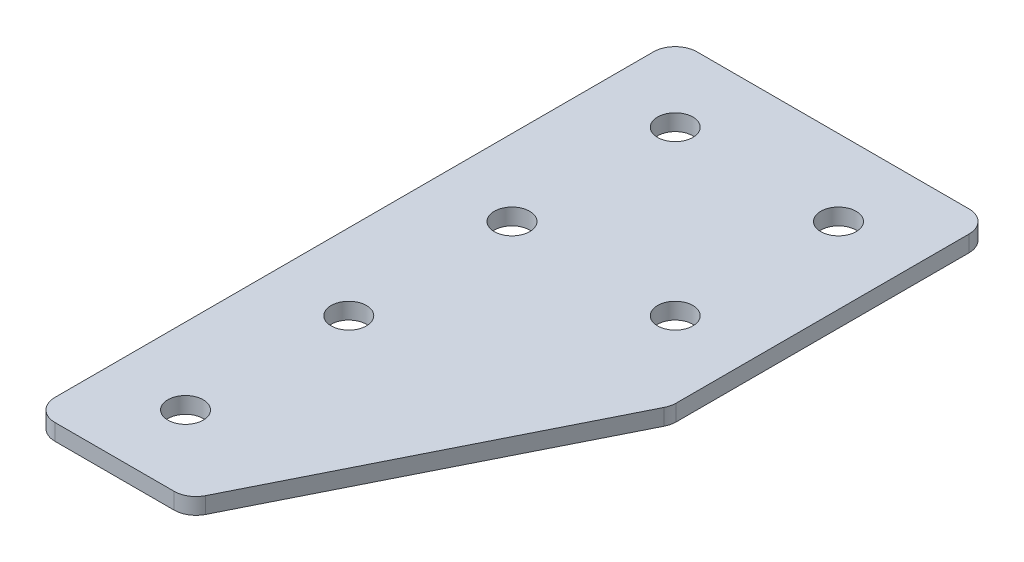
ISO-10303-21;
HEADER;
FILE_DESCRIPTION(('STEP AP214'),'2;1');
FILE_NAME('part.step','',(''),(''),'','','');
FILE_SCHEMA(('AUTOMOTIVE_DESIGN { 1 0 10303 214 1 1 1 1 }'));
ENDSEC;
DATA;
#1=APPLICATION_CONTEXT('core data for automotive mechanical design processes');
#2=APPLICATION_PROTOCOL_DEFINITION('international standard','automotive_design',2000,#1);
#3=PRODUCT_CONTEXT('',#1,'mechanical');
#4=PRODUCT('Part','Part','',(#3));
#5=PRODUCT_RELATED_PRODUCT_CATEGORY('part','',(#4));
#6=PRODUCT_DEFINITION_FORMATION('','',#4);
#7=PRODUCT_DEFINITION_CONTEXT('part definition',#1,'design');
#8=PRODUCT_DEFINITION('design','',#6,#7);
#9=PRODUCT_DEFINITION_SHAPE('','',#8);
#10=(LENGTH_UNIT() NAMED_UNIT(*) SI_UNIT(.MILLI.,.METRE.));
#11=(NAMED_UNIT(*) PLANE_ANGLE_UNIT() SI_UNIT($,.RADIAN.));
#12=(NAMED_UNIT(*) SI_UNIT($,.STERADIAN.) SOLID_ANGLE_UNIT());
#13=UNCERTAINTY_MEASURE_WITH_UNIT(LENGTH_MEASURE(1.E-05),#10,'distance_accuracy_value','');
#14=(GEOMETRIC_REPRESENTATION_CONTEXT(3) GLOBAL_UNCERTAINTY_ASSIGNED_CONTEXT((#13)) GLOBAL_UNIT_ASSIGNED_CONTEXT((#10,
#11,#12)) REPRESENTATION_CONTEXT('',''));
#15=CARTESIAN_POINT('',(0.,0.,0.));
#16=DIRECTION('',(0.,0.,1.));
#17=DIRECTION('',(1.,0.,0.));
#18=AXIS2_PLACEMENT_3D('',#15,#16,#17);
#19=CARTESIAN_POINT('',(-9.35772119630191,2.39126526069458,-23.7830335623448));
#20=DIRECTION('',(0.,-1.,0.));
#21=DIRECTION('',(0.,0.,-1.));
#22=AXIS2_PLACEMENT_3D('',#19,#20,#21);
#23=PLANE('',#22);
#24=CARTESIAN_POINT('',(5.64227880369808,2.39126526069458,-8.78303356234479));
#25=DIRECTION('',(0.,1.,0.));
#26=DIRECTION('',(0.,0.,1.));
#27=AXIS2_PLACEMENT_3D('',#24,#25,#26);
#28=CIRCLE('',#27,1.625);
#29=CARTESIAN_POINT('',(5.64227880369808,2.39126526069458,-7.15803356234479));
#30=VERTEX_POINT('',#29);
#31=EDGE_CURVE('E257',#30,#30,#28,.T.);
#32=ORIENTED_EDGE('',*,*,#31,.T.);
#33=EDGE_LOOP('',(#32));
#34=FACE_BOUND('',#33,.T.);
#35=CARTESIAN_POINT('',(-9.35772119630193,2.39126526069458,21.2169664376552));
#36=DIRECTION('',(0.,1.,0.));
#37=DIRECTION('',(0.,0.,1.));
#38=AXIS2_PLACEMENT_3D('',#35,#36,#37);
#39=CIRCLE('',#38,1.625);
#40=CARTESIAN_POINT('',(-9.35772119630193,2.39126526069458,22.8419664376552));
#41=VERTEX_POINT('',#40);
#42=EDGE_CURVE('E252',#41,#41,#39,.T.);
#43=ORIENTED_EDGE('',*,*,#42,.T.);
#44=EDGE_LOOP('',(#43));
#45=FACE_BOUND('',#44,.T.);
#46=CARTESIAN_POINT('',(-9.35772119630193,2.39126526069458,6.21696643765521));
#47=DIRECTION('',(0.,1.,0.));
#48=DIRECTION('',(0.,0.,1.));
#49=AXIS2_PLACEMENT_3D('',#46,#47,#48);
#50=CIRCLE('',#49,1.625);
#51=CARTESIAN_POINT('',(-9.35772119630193,2.39126526069458,7.84196643765521));
#52=VERTEX_POINT('',#51);
#53=EDGE_CURVE('E265',#52,#52,#50,.T.);
#54=ORIENTED_EDGE('',*,*,#53,.T.);
#55=EDGE_LOOP('',(#54));
#56=FACE_BOUND('',#55,.T.);
#57=CARTESIAN_POINT('',(-9.35772119630193,2.39126526069458,-8.78303356234479));
#58=DIRECTION('',(0.,1.,0.));
#59=DIRECTION('',(0.,0.,1.));
#60=AXIS2_PLACEMENT_3D('',#57,#58,#59);
#61=CIRCLE('',#60,1.625);
#62=CARTESIAN_POINT('',(-9.35772119630193,2.39126526069458,-7.15803356234479));
#63=VERTEX_POINT('',#62);
#64=EDGE_CURVE('E271',#63,#63,#61,.T.);
#65=ORIENTED_EDGE('',*,*,#64,.T.);
#66=EDGE_LOOP('',(#65));
#67=FACE_BOUND('',#66,.T.);
#68=CARTESIAN_POINT('',(5.64227880369808,2.39126526069458,-23.7830335623448));
#69=DIRECTION('',(0.,1.,0.));
#70=DIRECTION('',(0.,0.,1.));
#71=AXIS2_PLACEMENT_3D('',#68,#69,#70);
#72=CIRCLE('',#71,1.625);
#73=CARTESIAN_POINT('',(5.64227880369808,2.39126526069458,-22.1580335623448));
#74=VERTEX_POINT('',#73);
#75=EDGE_CURVE('E277',#74,#74,#72,.T.);
#76=ORIENTED_EDGE('',*,*,#75,.T.);
#77=EDGE_LOOP('',(#76));
#78=FACE_BOUND('',#77,.T.);
#79=CARTESIAN_POINT('',(-9.35772119630191,2.39126526069458,-23.7830335623448));
#80=DIRECTION('',(0.,1.,0.));
#81=DIRECTION('',(0.,0.,1.));
#82=AXIS2_PLACEMENT_3D('',#79,#80,#81);
#83=CIRCLE('',#82,1.625);
#84=CARTESIAN_POINT('',(-9.35772119630191,2.39126526069458,-22.1580335623448));
#85=VERTEX_POINT('',#84);
#86=EDGE_CURVE('E175',#85,#85,#83,.T.);
#87=ORIENTED_EDGE('',*,*,#86,.T.);
#88=EDGE_LOOP('',(#87));
#89=FACE_BOUND('',#88,.T.);
#90=DIRECTION('',(0.447213595499954,0.,-0.894427190999918));
#91=VECTOR('',#90,1.);
#92=CARTESIAN_POINT('',(-2.16673819067677,2.39126526069458,28.2169664376552));
#93=LINE('',#92,#91);
#94=CARTESIAN_POINT('',(-1.61395178617673,2.39126526069458,27.1113936286551));
#95=VERTEX_POINT('',#94);
#96=CARTESIAN_POINT('',(12.4311331856978,2.39126526069458,-0.978776315094385));
#97=VERTEX_POINT('',#96);
#98=EDGE_CURVE('E121',#95,#97,#93,.T.);
#99=ORIENTED_EDGE('',*,*,#98,.F.);
#100=CARTESIAN_POINT('',(-3.40280616817656,2.39126526069458,26.2169664376552));
#101=DIRECTION('',(0.,-1.,0.));
#102=DIRECTION('',(0.,0.,-1.));
#103=AXIS2_PLACEMENT_3D('',#100,#101,#102);
#104=CIRCLE('',#103,2.);
#105=CARTESIAN_POINT('',(-3.40280616817657,2.39126526069458,28.2169664376552));
#106=VERTEX_POINT('',#105);
#107=EDGE_CURVE('E145',#95,#106,#104,.T.);
#108=ORIENTED_EDGE('',*,*,#107,.T.);
#109=DIRECTION('',(1.,0.,0.));
#110=VECTOR('',#109,1.);
#111=CARTESIAN_POINT('',(-16.357721196302,2.39126526069458,28.2169664376552));
#112=LINE('',#111,#110);
#113=CARTESIAN_POINT('',(-14.357721196302,2.39126526069458,28.2169664376552));
#114=VERTEX_POINT('',#113);
#115=EDGE_CURVE('E162',#114,#106,#112,.T.);
#116=ORIENTED_EDGE('',*,*,#115,.F.);
#117=CARTESIAN_POINT('',(-14.357721196302,2.39126526069458,26.2169664376552));
#118=DIRECTION('',(0.,-1.,0.));
#119=DIRECTION('',(0.,0.,-1.));
#120=AXIS2_PLACEMENT_3D('',#117,#118,#119);
#121=CIRCLE('',#120,2.);
#122=CARTESIAN_POINT('',(-16.357721196302,2.39126526069458,26.2169664376552));
#123=VERTEX_POINT('',#122);
#124=EDGE_CURVE('E117',#114,#123,#121,.T.);
#125=ORIENTED_EDGE('',*,*,#124,.T.);
#126=DIRECTION('',(0.,0.,1.));
#127=VECTOR('',#126,1.);
#128=CARTESIAN_POINT('',(-16.357721196302,2.39126526069458,-30.7830335623448));
#129=LINE('',#128,#127);
#130=CARTESIAN_POINT('',(-16.357721196302,2.39126526069458,-28.7830335623448));
#131=VERTEX_POINT('',#130);
#132=EDGE_CURVE('E160',#131,#123,#129,.T.);
#133=ORIENTED_EDGE('',*,*,#132,.F.);
#134=CARTESIAN_POINT('',(-14.357721196302,2.39126526069458,-28.7830335623448));
#135=DIRECTION('',(0.,-1.,0.));
#136=DIRECTION('',(0.,0.,-1.));
#137=AXIS2_PLACEMENT_3D('',#134,#135,#136);
#138=CIRCLE('',#137,2.);
#139=CARTESIAN_POINT('',(-14.357721196302,2.39126526069458,-30.7830335623448));
#140=VERTEX_POINT('',#139);
#141=EDGE_CURVE('E140',#131,#140,#138,.T.);
#142=ORIENTED_EDGE('',*,*,#141,.T.);
#143=DIRECTION('',(-1.,0.,0.));
#144=VECTOR('',#143,1.);
#145=CARTESIAN_POINT('',(12.642278803698,2.39126526069458,-30.7830335623448));
#146=LINE('',#145,#144);
#147=CARTESIAN_POINT('',(10.642278803698,2.39126526069458,-30.7830335623448));
#148=VERTEX_POINT('',#147);
#149=EDGE_CURVE('E163',#148,#140,#146,.T.);
#150=ORIENTED_EDGE('',*,*,#149,.F.);
#151=CARTESIAN_POINT('',(10.642278803698,2.39126526069458,-28.7830335623448));
#152=DIRECTION('',(0.,-1.,0.));
#153=DIRECTION('',(0.,0.,-1.));
#154=AXIS2_PLACEMENT_3D('',#151,#152,#153);
#155=CIRCLE('',#154,2.);
#156=CARTESIAN_POINT('',(12.642278803698,2.39126526069458,-28.7830335623448));
#157=VERTEX_POINT('',#156);
#158=EDGE_CURVE('E31',#148,#157,#155,.T.);
#159=ORIENTED_EDGE('',*,*,#158,.T.);
#160=DIRECTION('',(0.,0.,-1.));
#161=VECTOR('',#160,1.);
#162=CARTESIAN_POINT('',(12.642278803698,2.39126526069458,-1.40106755109472));
#163=LINE('',#162,#161);
#164=CARTESIAN_POINT('',(12.642278803698,2.39126526069458,-1.87320350609428));
#165=VERTEX_POINT('',#164);
#166=EDGE_CURVE('E118',#165,#157,#163,.T.);
#167=ORIENTED_EDGE('',*,*,#166,.F.);
#168=CARTESIAN_POINT('',(10.642278803698,2.39126526069458,-1.87320350609428));
#169=DIRECTION('',(0.,-1.,0.));
#170=DIRECTION('',(0.,0.,-1.));
#171=AXIS2_PLACEMENT_3D('',#168,#169,#170);
#172=CIRCLE('',#171,2.);
#173=EDGE_CURVE('E143',#165,#97,#172,.T.);
#174=ORIENTED_EDGE('',*,*,#173,.T.);
#175=EDGE_LOOP('',(#99,#108,#116,#125,#133,#142,#150,#159,#167,#174));
#176=FACE_BOUND('',#175,.T.);
#177=ADVANCED_FACE('F16',(#34,#45,#56,#67,#78,#89,#176),#23,.T.);
#178=CARTESIAN_POINT('',(12.642278803698,2.39126526069458,-30.7830335623448));
#179=DIRECTION('',(0.,0.,-1.));
#180=DIRECTION('',(-1.,0.,0.));
#181=AXIS2_PLACEMENT_3D('',#178,#179,#180);
#182=PLANE('',#181);
#183=DIRECTION('',(-1.,0.,0.));
#184=VECTOR('',#183,1.);
#185=CARTESIAN_POINT('',(12.642278803698,3.89126526069458,-30.7830335623448));
#186=LINE('',#185,#184);
#187=CARTESIAN_POINT('',(10.642278803698,3.89126526069458,-30.7830335623448));
#188=VERTEX_POINT('',#187);
#189=CARTESIAN_POINT('',(-14.357721196302,3.89126526069458,-30.7830335623448));
#190=VERTEX_POINT('',#189);
#191=EDGE_CURVE('E172',#188,#190,#186,.T.);
#192=ORIENTED_EDGE('',*,*,#191,.F.);
#193=DIRECTION('',(0.,1.,0.));
#194=VECTOR('',#193,1.);
#195=CARTESIAN_POINT('',(10.642278803698,2.39126526069458,-30.7830335623448));
#196=LINE('',#195,#194);
#197=EDGE_CURVE('E154',#188,#148,#196,.F.);
#198=ORIENTED_EDGE('',*,*,#197,.T.);
#199=ORIENTED_EDGE('',*,*,#149,.T.);
#200=DIRECTION('',(0.,1.,0.));
#201=VECTOR('',#200,1.);
#202=CARTESIAN_POINT('',(-14.357721196302,2.39126526069458,-30.7830335623448));
#203=LINE('',#202,#201);
#204=EDGE_CURVE('E151',#140,#190,#203,.T.);
#205=ORIENTED_EDGE('',*,*,#204,.T.);
#206=EDGE_LOOP('',(#192,#198,#199,#205));
#207=FACE_BOUND('',#206,.T.);
#208=ADVANCED_FACE('F208',(#207),#182,.T.);
#209=CARTESIAN_POINT('',(12.642278803698,2.39126526069458,-1.40106755109472));
#210=DIRECTION('',(1.,0.,0.));
#211=DIRECTION('',(0.,0.,-1.));
#212=AXIS2_PLACEMENT_3D('',#209,#210,#211);
#213=PLANE('',#212);
#214=DIRECTION('',(0.,0.,-1.));
#215=VECTOR('',#214,1.);
#216=CARTESIAN_POINT('',(12.642278803698,3.89126526069458,-1.40106755109472));
#217=LINE('',#216,#215);
#218=CARTESIAN_POINT('',(12.642278803698,3.89126526069458,-1.87320350609428));
#219=VERTEX_POINT('',#218);
#220=CARTESIAN_POINT('',(12.642278803698,3.89126526069458,-28.7830335623448));
#221=VERTEX_POINT('',#220);
#222=EDGE_CURVE('E124',#219,#221,#217,.T.);
#223=ORIENTED_EDGE('',*,*,#222,.F.);
#224=DIRECTION('',(0.,1.,0.));
#225=VECTOR('',#224,1.);
#226=CARTESIAN_POINT('',(12.642278803698,2.39126526069458,-1.87320350609428));
#227=LINE('',#226,#225);
#228=EDGE_CURVE('E38',#219,#165,#227,.F.);
#229=ORIENTED_EDGE('',*,*,#228,.T.);
#230=ORIENTED_EDGE('',*,*,#166,.T.);
#231=DIRECTION('',(0.,1.,0.));
#232=VECTOR('',#231,1.);
#233=CARTESIAN_POINT('',(12.642278803698,2.39126526069458,-28.7830335623448));
#234=LINE('',#233,#232);
#235=EDGE_CURVE('E147',#157,#221,#234,.T.);
#236=ORIENTED_EDGE('',*,*,#235,.T.);
#237=EDGE_LOOP('',(#223,#229,#230,#236));
#238=FACE_BOUND('',#237,.T.);
#239=ADVANCED_FACE('F180',(#238),#213,.T.);
#240=CARTESIAN_POINT('',(-2.16673819067677,2.39126526069458,28.2169664376552));
#241=DIRECTION('',(0.894427190999918,0.,0.447213595499953));
#242=DIRECTION('',(0.447213595499954,0.,-0.894427190999918));
#243=AXIS2_PLACEMENT_3D('',#240,#241,#242);
#244=PLANE('',#243);
#245=DIRECTION('',(0.447213595499954,0.,-0.894427190999918));
#246=VECTOR('',#245,1.);
#247=CARTESIAN_POINT('',(-2.16673819067677,3.89126526069458,28.2169664376552));
#248=LINE('',#247,#246);
#249=CARTESIAN_POINT('',(-1.61395178617673,3.89126526069458,27.1113936286551));
#250=VERTEX_POINT('',#249);
#251=CARTESIAN_POINT('',(12.4311331856978,3.89126526069458,-0.978776315094385));
#252=VERTEX_POINT('',#251);
#253=EDGE_CURVE('E114',#250,#252,#248,.T.);
#254=ORIENTED_EDGE('',*,*,#253,.F.);
#255=DIRECTION('',(0.,1.,0.));
#256=VECTOR('',#255,1.);
#257=CARTESIAN_POINT('',(-1.61395178617673,2.39126526069458,27.1113936286551));
#258=LINE('',#257,#256);
#259=EDGE_CURVE('E137',#250,#95,#258,.F.);
#260=ORIENTED_EDGE('',*,*,#259,.T.);
#261=ORIENTED_EDGE('',*,*,#98,.T.);
#262=DIRECTION('',(0.,1.,0.));
#263=VECTOR('',#262,1.);
#264=CARTESIAN_POINT('',(12.4311331856978,2.39126526069458,-0.978776315094378));
#265=LINE('',#264,#263);
#266=EDGE_CURVE('E134',#97,#252,#265,.T.);
#267=ORIENTED_EDGE('',*,*,#266,.T.);
#268=EDGE_LOOP('',(#254,#260,#261,#267));
#269=FACE_BOUND('',#268,.T.);
#270=ADVANCED_FACE('F189',(#269),#244,.T.);
#271=CARTESIAN_POINT('',(-16.357721196302,2.39126526069458,28.2169664376552));
#272=DIRECTION('',(0.,0.,1.));
#273=DIRECTION('',(1.,0.,0.));
#274=AXIS2_PLACEMENT_3D('',#271,#272,#273);
#275=PLANE('',#274);
#276=ORIENTED_EDGE('',*,*,#115,.T.);
#277=DIRECTION('',(0.,1.,0.));
#278=VECTOR('',#277,1.);
#279=CARTESIAN_POINT('',(-3.40280616817656,2.39126526069458,28.2169664376552));
#280=LINE('',#279,#278);
#281=CARTESIAN_POINT('',(-3.40280616817657,3.89126526069458,28.2169664376552));
#282=VERTEX_POINT('',#281);
#283=EDGE_CURVE('E105',#106,#282,#280,.T.);
#284=ORIENTED_EDGE('',*,*,#283,.T.);
#285=DIRECTION('',(1.,0.,0.));
#286=VECTOR('',#285,1.);
#287=CARTESIAN_POINT('',(-16.357721196302,3.89126526069458,28.2169664376552));
#288=LINE('',#287,#286);
#289=CARTESIAN_POINT('',(-14.357721196302,3.89126526069458,28.2169664376552));
#290=VERTEX_POINT('',#289);
#291=EDGE_CURVE('E97',#290,#282,#288,.T.);
#292=ORIENTED_EDGE('',*,*,#291,.F.);
#293=DIRECTION('',(0.,1.,0.));
#294=VECTOR('',#293,1.);
#295=CARTESIAN_POINT('',(-14.357721196302,2.39126526069458,28.2169664376552));
#296=LINE('',#295,#294);
#297=EDGE_CURVE('E111',#290,#114,#296,.F.);
#298=ORIENTED_EDGE('',*,*,#297,.T.);
#299=EDGE_LOOP('',(#276,#284,#292,#298));
#300=FACE_BOUND('',#299,.T.);
#301=ADVANCED_FACE('F110',(#300),#275,.T.);
#302=CARTESIAN_POINT('',(-16.357721196302,2.39126526069458,-30.7830335623448));
#303=DIRECTION('',(-1.,0.,0.));
#304=DIRECTION('',(0.,0.,1.));
#305=AXIS2_PLACEMENT_3D('',#302,#303,#304);
#306=PLANE('',#305);
#307=DIRECTION('',(0.,0.,1.));
#308=VECTOR('',#307,1.);
#309=CARTESIAN_POINT('',(-16.357721196302,3.89126526069458,-30.7830335623448));
#310=LINE('',#309,#308);
#311=CARTESIAN_POINT('',(-16.357721196302,3.89126526069458,-28.7830335623448));
#312=VERTEX_POINT('',#311);
#313=CARTESIAN_POINT('',(-16.357721196302,3.89126526069458,26.2169664376552));
#314=VERTEX_POINT('',#313);
#315=EDGE_CURVE('E99',#312,#314,#310,.T.);
#316=ORIENTED_EDGE('',*,*,#315,.F.);
#317=DIRECTION('',(0.,1.,0.));
#318=VECTOR('',#317,1.);
#319=CARTESIAN_POINT('',(-16.357721196302,2.39126526069458,-28.7830335623448));
#320=LINE('',#319,#318);
#321=EDGE_CURVE('E10',#312,#131,#320,.F.);
#322=ORIENTED_EDGE('',*,*,#321,.T.);
#323=ORIENTED_EDGE('',*,*,#132,.T.);
#324=DIRECTION('',(0.,1.,0.));
#325=VECTOR('',#324,1.);
#326=CARTESIAN_POINT('',(-16.357721196302,2.39126526069458,26.2169664376552));
#327=LINE('',#326,#325);
#328=EDGE_CURVE('E24',#123,#314,#327,.T.);
#329=ORIENTED_EDGE('',*,*,#328,.T.);
#330=EDGE_LOOP('',(#316,#322,#323,#329));
#331=FACE_BOUND('',#330,.T.);
#332=ADVANCED_FACE('F157',(#331),#306,.T.);
#333=CARTESIAN_POINT('',(-9.35772119630191,3.89126526069458,-23.7830335623448));
#334=DIRECTION('',(0.,-1.,0.));
#335=DIRECTION('',(0.,0.,-1.));
#336=AXIS2_PLACEMENT_3D('',#333,#334,#335);
#337=PLANE('',#336);
#338=CARTESIAN_POINT('',(5.64227880369808,3.89126526069458,-8.78303356234479));
#339=DIRECTION('',(0.,1.,0.));
#340=DIRECTION('',(0.,0.,1.));
#341=AXIS2_PLACEMENT_3D('',#338,#339,#340);
#342=CIRCLE('',#341,1.625);
#343=CARTESIAN_POINT('',(5.64227880369808,3.89126526069458,-7.15803356234479));
#344=VERTEX_POINT('',#343);
#345=EDGE_CURVE('E261',#344,#344,#342,.T.);
#346=ORIENTED_EDGE('',*,*,#345,.F.);
#347=EDGE_LOOP('',(#346));
#348=FACE_BOUND('',#347,.T.);
#349=CARTESIAN_POINT('',(-9.35772119630193,3.89126526069458,21.2169664376552));
#350=DIRECTION('',(0.,1.,0.));
#351=DIRECTION('',(0.,0.,1.));
#352=AXIS2_PLACEMENT_3D('',#349,#350,#351);
#353=CIRCLE('',#352,1.625);
#354=CARTESIAN_POINT('',(-9.35772119630193,3.89126526069458,22.8419664376552));
#355=VERTEX_POINT('',#354);
#356=EDGE_CURVE('E255',#355,#355,#353,.T.);
#357=ORIENTED_EDGE('',*,*,#356,.F.);
#358=EDGE_LOOP('',(#357));
#359=FACE_BOUND('',#358,.T.);
#360=CARTESIAN_POINT('',(-9.35772119630193,3.89126526069458,6.21696643765521));
#361=DIRECTION('',(0.,1.,0.));
#362=DIRECTION('',(0.,0.,1.));
#363=AXIS2_PLACEMENT_3D('',#360,#361,#362);
#364=CIRCLE('',#363,1.625);
#365=CARTESIAN_POINT('',(-9.35772119630193,3.89126526069458,7.84196643765521));
#366=VERTEX_POINT('',#365);
#367=EDGE_CURVE('E259',#366,#366,#364,.T.);
#368=ORIENTED_EDGE('',*,*,#367,.F.);
#369=EDGE_LOOP('',(#368));
#370=FACE_BOUND('',#369,.T.);
#371=CARTESIAN_POINT('',(-9.35772119630193,3.89126526069458,-8.78303356234479));
#372=DIRECTION('',(0.,1.,0.));
#373=DIRECTION('',(0.,0.,1.));
#374=AXIS2_PLACEMENT_3D('',#371,#372,#373);
#375=CIRCLE('',#374,1.625);
#376=CARTESIAN_POINT('',(-9.35772119630193,3.89126526069458,-7.15803356234479));
#377=VERTEX_POINT('',#376);
#378=EDGE_CURVE('E268',#377,#377,#375,.T.);
#379=ORIENTED_EDGE('',*,*,#378,.F.);
#380=EDGE_LOOP('',(#379));
#381=FACE_BOUND('',#380,.T.);
#382=CARTESIAN_POINT('',(5.64227880369808,3.89126526069458,-23.7830335623448));
#383=DIRECTION('',(0.,1.,0.));
#384=DIRECTION('',(0.,0.,1.));
#385=AXIS2_PLACEMENT_3D('',#382,#383,#384);
#386=CIRCLE('',#385,1.625);
#387=CARTESIAN_POINT('',(5.64227880369808,3.89126526069458,-22.1580335623448));
#388=VERTEX_POINT('',#387);
#389=EDGE_CURVE('E274',#388,#388,#386,.T.);
#390=ORIENTED_EDGE('',*,*,#389,.F.);
#391=EDGE_LOOP('',(#390));
#392=FACE_BOUND('',#391,.T.);
#393=CARTESIAN_POINT('',(-9.35772119630191,3.89126526069458,-23.7830335623448));
#394=DIRECTION('',(0.,1.,0.));
#395=DIRECTION('',(0.,0.,1.));
#396=AXIS2_PLACEMENT_3D('',#393,#394,#395);
#397=CIRCLE('',#396,1.625);
#398=CARTESIAN_POINT('',(-9.35772119630191,3.89126526069458,-22.1580335623448));
#399=VERTEX_POINT('',#398);
#400=EDGE_CURVE('E280',#399,#399,#397,.T.);
#401=ORIENTED_EDGE('',*,*,#400,.F.);
#402=EDGE_LOOP('',(#401));
#403=FACE_BOUND('',#402,.T.);
#404=ORIENTED_EDGE('',*,*,#291,.T.);
#405=CARTESIAN_POINT('',(-3.40280616817656,3.89126526069458,26.2169664376552));
#406=DIRECTION('',(0.,-1.,0.));
#407=DIRECTION('',(0.,0.,-1.));
#408=AXIS2_PLACEMENT_3D('',#405,#406,#407);
#409=CIRCLE('',#408,2.);
#410=EDGE_CURVE('E132',#282,#250,#409,.F.);
#411=ORIENTED_EDGE('',*,*,#410,.T.);
#412=ORIENTED_EDGE('',*,*,#253,.T.);
#413=CARTESIAN_POINT('',(10.642278803698,3.89126526069458,-1.87320350609428));
#414=DIRECTION('',(0.,-1.,0.));
#415=DIRECTION('',(0.,0.,-1.));
#416=AXIS2_PLACEMENT_3D('',#413,#414,#415);
#417=CIRCLE('',#416,2.);
#418=EDGE_CURVE('E130',#252,#219,#417,.F.);
#419=ORIENTED_EDGE('',*,*,#418,.T.);
#420=ORIENTED_EDGE('',*,*,#222,.T.);
#421=CARTESIAN_POINT('',(10.642278803698,3.89126526069458,-28.7830335623448));
#422=DIRECTION('',(0.,-1.,0.));
#423=DIRECTION('',(0.,0.,-1.));
#424=AXIS2_PLACEMENT_3D('',#421,#422,#423);
#425=CIRCLE('',#424,2.);
#426=EDGE_CURVE('E128',#221,#188,#425,.F.);
#427=ORIENTED_EDGE('',*,*,#426,.T.);
#428=ORIENTED_EDGE('',*,*,#191,.T.);
#429=CARTESIAN_POINT('',(-14.357721196302,3.89126526069458,-28.7830335623448));
#430=DIRECTION('',(0.,-1.,0.));
#431=DIRECTION('',(0.,0.,-1.));
#432=AXIS2_PLACEMENT_3D('',#429,#430,#431);
#433=CIRCLE('',#432,2.);
#434=EDGE_CURVE('E104',#190,#312,#433,.F.);
#435=ORIENTED_EDGE('',*,*,#434,.T.);
#436=ORIENTED_EDGE('',*,*,#315,.T.);
#437=CARTESIAN_POINT('',(-14.357721196302,3.89126526069458,26.2169664376552));
#438=DIRECTION('',(0.,-1.,0.));
#439=DIRECTION('',(0.,0.,-1.));
#440=AXIS2_PLACEMENT_3D('',#437,#438,#439);
#441=CIRCLE('',#440,2.);
#442=EDGE_CURVE('E94',#314,#290,#441,.F.);
#443=ORIENTED_EDGE('',*,*,#442,.T.);
#444=EDGE_LOOP('',(#404,#411,#412,#419,#420,#427,#428,#435,#436,#443));
#445=FACE_BOUND('',#444,.T.);
#446=ADVANCED_FACE('F96',(#348,#359,#370,#381,#392,#403,#445),#337,.F.);
#447=CARTESIAN_POINT('',(-9.35772119630191,2.39126526069458,-23.7830335623448));
#448=DIRECTION('',(0.,1.,0.));
#449=DIRECTION('',(0.,0.,1.));
#450=AXIS2_PLACEMENT_3D('',#447,#448,#449);
#451=CYLINDRICAL_SURFACE('',#450,1.625);
#452=ORIENTED_EDGE('',*,*,#86,.F.);
#453=EDGE_LOOP('',(#452));
#454=FACE_BOUND('',#453,.T.);
#455=ORIENTED_EDGE('',*,*,#400,.T.);
#456=EDGE_LOOP('',(#455));
#457=FACE_BOUND('',#456,.T.);
#458=ADVANCED_FACE('F219',(#454,#457),#451,.F.);
#459=CARTESIAN_POINT('',(5.64227880369808,2.39126526069458,-23.7830335623448));
#460=DIRECTION('',(0.,1.,0.));
#461=DIRECTION('',(0.,0.,1.));
#462=AXIS2_PLACEMENT_3D('',#459,#460,#461);
#463=CYLINDRICAL_SURFACE('',#462,1.625);
#464=ORIENTED_EDGE('',*,*,#75,.F.);
#465=EDGE_LOOP('',(#464));
#466=FACE_BOUND('',#465,.T.);
#467=ORIENTED_EDGE('',*,*,#389,.T.);
#468=EDGE_LOOP('',(#467));
#469=FACE_BOUND('',#468,.T.);
#470=ADVANCED_FACE('F232',(#466,#469),#463,.F.);
#471=CARTESIAN_POINT('',(-9.35772119630193,2.39126526069458,-8.78303356234479));
#472=DIRECTION('',(0.,1.,0.));
#473=DIRECTION('',(0.,0.,1.));
#474=AXIS2_PLACEMENT_3D('',#471,#472,#473);
#475=CYLINDRICAL_SURFACE('',#474,1.625);
#476=ORIENTED_EDGE('',*,*,#64,.F.);
#477=EDGE_LOOP('',(#476));
#478=FACE_BOUND('',#477,.T.);
#479=ORIENTED_EDGE('',*,*,#378,.T.);
#480=EDGE_LOOP('',(#479));
#481=FACE_BOUND('',#480,.T.);
#482=ADVANCED_FACE('F236',(#478,#481),#475,.F.);
#483=CARTESIAN_POINT('',(-9.35772119630193,2.39126526069458,6.21696643765521));
#484=DIRECTION('',(0.,1.,0.));
#485=DIRECTION('',(0.,0.,1.));
#486=AXIS2_PLACEMENT_3D('',#483,#484,#485);
#487=CYLINDRICAL_SURFACE('',#486,1.625);
#488=ORIENTED_EDGE('',*,*,#53,.F.);
#489=EDGE_LOOP('',(#488));
#490=FACE_BOUND('',#489,.T.);
#491=ORIENTED_EDGE('',*,*,#367,.T.);
#492=EDGE_LOOP('',(#491));
#493=FACE_BOUND('',#492,.T.);
#494=ADVANCED_FACE('F240',(#490,#493),#487,.F.);
#495=CARTESIAN_POINT('',(-9.35772119630193,2.39126526069458,21.2169664376552));
#496=DIRECTION('',(0.,1.,0.));
#497=DIRECTION('',(0.,0.,1.));
#498=AXIS2_PLACEMENT_3D('',#495,#496,#497);
#499=CYLINDRICAL_SURFACE('',#498,1.625);
#500=ORIENTED_EDGE('',*,*,#42,.F.);
#501=EDGE_LOOP('',(#500));
#502=FACE_BOUND('',#501,.T.);
#503=ORIENTED_EDGE('',*,*,#356,.T.);
#504=EDGE_LOOP('',(#503));
#505=FACE_BOUND('',#504,.T.);
#506=ADVANCED_FACE('F203',(#502,#505),#499,.F.);
#507=CARTESIAN_POINT('',(5.64227880369808,2.39126526069458,-8.78303356234479));
#508=DIRECTION('',(0.,1.,0.));
#509=DIRECTION('',(0.,0.,1.));
#510=AXIS2_PLACEMENT_3D('',#507,#508,#509);
#511=CYLINDRICAL_SURFACE('',#510,1.625);
#512=ORIENTED_EDGE('',*,*,#31,.F.);
#513=EDGE_LOOP('',(#512));
#514=FACE_BOUND('',#513,.T.);
#515=ORIENTED_EDGE('',*,*,#345,.T.);
#516=EDGE_LOOP('',(#515));
#517=FACE_BOUND('',#516,.T.);
#518=ADVANCED_FACE('F194',(#514,#517),#511,.F.);
#519=CARTESIAN_POINT('',(-3.40280616817656,2.39126526069458,26.2169664376552));
#520=DIRECTION('',(0.,1.,0.));
#521=DIRECTION('',(0.,0.,1.));
#522=AXIS2_PLACEMENT_3D('',#519,#520,#521);
#523=CYLINDRICAL_SURFACE('',#522,2.);
#524=ORIENTED_EDGE('',*,*,#107,.F.);
#525=ORIENTED_EDGE('',*,*,#259,.F.);
#526=ORIENTED_EDGE('',*,*,#410,.F.);
#527=ORIENTED_EDGE('',*,*,#283,.F.);
#528=EDGE_LOOP('',(#524,#525,#526,#527));
#529=FACE_BOUND('',#528,.T.);
#530=ADVANCED_FACE('F192',(#529),#523,.T.);
#531=CARTESIAN_POINT('',(10.642278803698,2.39126526069458,-1.87320350609428));
#532=DIRECTION('',(0.,1.,0.));
#533=DIRECTION('',(0.,0.,1.));
#534=AXIS2_PLACEMENT_3D('',#531,#532,#533);
#535=CYLINDRICAL_SURFACE('',#534,2.);
#536=ORIENTED_EDGE('',*,*,#173,.F.);
#537=ORIENTED_EDGE('',*,*,#228,.F.);
#538=ORIENTED_EDGE('',*,*,#418,.F.);
#539=ORIENTED_EDGE('',*,*,#266,.F.);
#540=EDGE_LOOP('',(#536,#537,#538,#539));
#541=FACE_BOUND('',#540,.T.);
#542=ADVANCED_FACE('F184',(#541),#535,.T.);
#543=CARTESIAN_POINT('',(10.642278803698,2.39126526069458,-28.7830335623448));
#544=DIRECTION('',(0.,1.,0.));
#545=DIRECTION('',(0.,0.,1.));
#546=AXIS2_PLACEMENT_3D('',#543,#544,#545);
#547=CYLINDRICAL_SURFACE('',#546,2.);
#548=ORIENTED_EDGE('',*,*,#158,.F.);
#549=ORIENTED_EDGE('',*,*,#197,.F.);
#550=ORIENTED_EDGE('',*,*,#426,.F.);
#551=ORIENTED_EDGE('',*,*,#235,.F.);
#552=EDGE_LOOP('',(#548,#549,#550,#551));
#553=FACE_BOUND('',#552,.T.);
#554=ADVANCED_FACE('F201',(#553),#547,.T.);
#555=CARTESIAN_POINT('',(-14.357721196302,2.39126526069458,-28.7830335623448));
#556=DIRECTION('',(0.,1.,0.));
#557=DIRECTION('',(0.,0.,1.));
#558=AXIS2_PLACEMENT_3D('',#555,#556,#557);
#559=CYLINDRICAL_SURFACE('',#558,2.);
#560=ORIENTED_EDGE('',*,*,#141,.F.);
#561=ORIENTED_EDGE('',*,*,#321,.F.);
#562=ORIENTED_EDGE('',*,*,#434,.F.);
#563=ORIENTED_EDGE('',*,*,#204,.F.);
#564=EDGE_LOOP('',(#560,#561,#562,#563));
#565=FACE_BOUND('',#564,.T.);
#566=ADVANCED_FACE('F339',(#565),#559,.T.);
#567=CARTESIAN_POINT('',(-14.357721196302,2.39126526069458,26.2169664376552));
#568=DIRECTION('',(0.,1.,0.));
#569=DIRECTION('',(0.,0.,1.));
#570=AXIS2_PLACEMENT_3D('',#567,#568,#569);
#571=CYLINDRICAL_SURFACE('',#570,2.);
#572=ORIENTED_EDGE('',*,*,#124,.F.);
#573=ORIENTED_EDGE('',*,*,#297,.F.);
#574=ORIENTED_EDGE('',*,*,#442,.F.);
#575=ORIENTED_EDGE('',*,*,#328,.F.);
#576=EDGE_LOOP('',(#572,#573,#574,#575));
#577=FACE_BOUND('',#576,.T.);
#578=ADVANCED_FACE('F18',(#577),#571,.T.);
#579=CLOSED_SHELL('',(#177,#208,#239,#270,#301,#332,#446,#458,#470,#482,#494,#506,#518,#530,
#542,#554,#566,#578));
#580=MANIFOLD_SOLID_BREP('B1',#579);
#581=ADVANCED_BREP_SHAPE_REPRESENTATION('',(#18,#580),#14);
#582=SHAPE_DEFINITION_REPRESENTATION(#9,#581);
ENDSEC;
END-ISO-10303-21;
